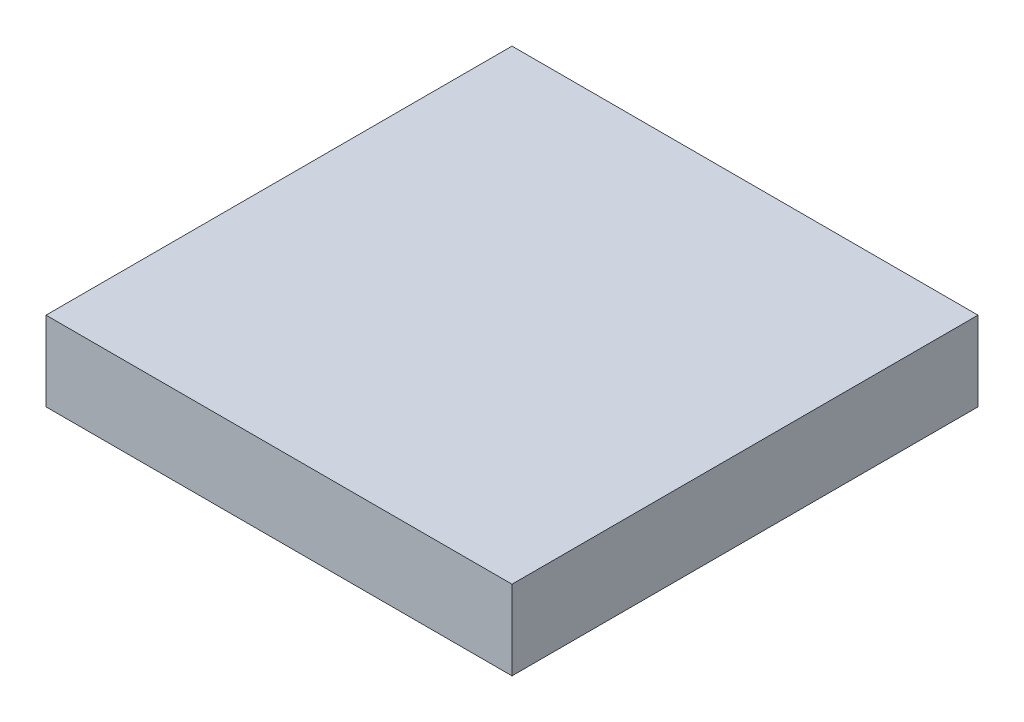
ISO-10303-21;
HEADER;
FILE_DESCRIPTION(('STEP AP214'),'2;1');
FILE_NAME('part.step','',(''),(''),'','','');
FILE_SCHEMA(('AUTOMOTIVE_DESIGN { 1 0 10303 214 1 1 1 1 }'));
ENDSEC;
DATA;
#1=APPLICATION_CONTEXT('core data for automotive mechanical design processes');
#2=APPLICATION_PROTOCOL_DEFINITION('international standard','automotive_design',2000,#1);
#3=PRODUCT_CONTEXT('',#1,'mechanical');
#4=PRODUCT('Part','Part','',(#3));
#5=PRODUCT_RELATED_PRODUCT_CATEGORY('part','',(#4));
#6=PRODUCT_DEFINITION_FORMATION('','',#4);
#7=PRODUCT_DEFINITION_CONTEXT('part definition',#1,'design');
#8=PRODUCT_DEFINITION('design','',#6,#7);
#9=PRODUCT_DEFINITION_SHAPE('','',#8);
#10=(LENGTH_UNIT() NAMED_UNIT(*) SI_UNIT(.MILLI.,.METRE.));
#11=(NAMED_UNIT(*) PLANE_ANGLE_UNIT() SI_UNIT($,.RADIAN.));
#12=(NAMED_UNIT(*) SI_UNIT($,.STERADIAN.) SOLID_ANGLE_UNIT());
#13=UNCERTAINTY_MEASURE_WITH_UNIT(LENGTH_MEASURE(1.E-05),#10,'distance_accuracy_value','');
#14=(GEOMETRIC_REPRESENTATION_CONTEXT(3) GLOBAL_UNCERTAINTY_ASSIGNED_CONTEXT((#13)) GLOBAL_UNIT_ASSIGNED_CONTEXT((#10,
#11,#12)) REPRESENTATION_CONTEXT('',''));
#15=CARTESIAN_POINT('',(0.,0.,0.));
#16=DIRECTION('',(0.,0.,1.));
#17=DIRECTION('',(1.,0.,0.));
#18=AXIS2_PLACEMENT_3D('',#15,#16,#17);
#19=CARTESIAN_POINT('',(-11.,3.75,11.));
#20=DIRECTION('',(1.,0.,0.));
#21=DIRECTION('',(0.,0.,-1.));
#22=AXIS2_PLACEMENT_3D('',#19,#20,#21);
#23=PLANE('',#22);
#24=DIRECTION('',(0.,0.,1.));
#25=VECTOR('',#24,1.);
#26=CARTESIAN_POINT('',(-11.,0.,11.));
#27=LINE('',#26,#25);
#28=CARTESIAN_POINT('',(-11.,0.,-11.));
#29=VERTEX_POINT('',#28);
#30=CARTESIAN_POINT('',(-11.,0.,11.));
#31=VERTEX_POINT('',#30);
#32=EDGE_CURVE('E96',#29,#31,#27,.T.);
#33=ORIENTED_EDGE('',*,*,#32,.T.);
#34=DIRECTION('',(0.,-1.,0.));
#35=VECTOR('',#34,1.);
#36=CARTESIAN_POINT('',(-11.,3.75,11.));
#37=LINE('',#36,#35);
#38=CARTESIAN_POINT('',(-11.,3.75,11.));
#39=VERTEX_POINT('',#38);
#40=EDGE_CURVE('E11',#39,#31,#37,.T.);
#41=ORIENTED_EDGE('',*,*,#40,.F.);
#42=DIRECTION('',(0.,0.,1.));
#43=VECTOR('',#42,1.);
#44=CARTESIAN_POINT('',(-11.,3.75,11.));
#45=LINE('',#44,#43);
#46=CARTESIAN_POINT('',(-11.,3.75,-11.));
#47=VERTEX_POINT('',#46);
#48=EDGE_CURVE('E84',#47,#39,#45,.T.);
#49=ORIENTED_EDGE('',*,*,#48,.F.);
#50=DIRECTION('',(0.,-1.,0.));
#51=VECTOR('',#50,1.);
#52=CARTESIAN_POINT('',(-11.,3.75,-11.));
#53=LINE('',#52,#51);
#54=EDGE_CURVE('E92',#47,#29,#53,.T.);
#55=ORIENTED_EDGE('',*,*,#54,.T.);
#56=EDGE_LOOP('',(#33,#41,#49,#55));
#57=FACE_BOUND('',#56,.T.);
#58=ADVANCED_FACE('F33',(#57),#23,.F.);
#59=CARTESIAN_POINT('',(11.,3.75,11.));
#60=DIRECTION('',(0.,0.,-1.));
#61=DIRECTION('',(-1.,0.,0.));
#62=AXIS2_PLACEMENT_3D('',#59,#60,#61);
#63=PLANE('',#62);
#64=DIRECTION('',(1.,0.,0.));
#65=VECTOR('',#64,1.);
#66=CARTESIAN_POINT('',(11.,0.,11.));
#67=LINE('',#66,#65);
#68=CARTESIAN_POINT('',(11.,0.,11.));
#69=VERTEX_POINT('',#68);
#70=EDGE_CURVE('E88',#31,#69,#67,.T.);
#71=ORIENTED_EDGE('',*,*,#70,.T.);
#72=DIRECTION('',(0.,-1.,0.));
#73=VECTOR('',#72,1.);
#74=CARTESIAN_POINT('',(11.,3.75,11.));
#75=LINE('',#74,#73);
#76=CARTESIAN_POINT('',(11.,3.75,11.));
#77=VERTEX_POINT('',#76);
#78=EDGE_CURVE('E41',#77,#69,#75,.T.);
#79=ORIENTED_EDGE('',*,*,#78,.F.);
#80=DIRECTION('',(1.,0.,0.));
#81=VECTOR('',#80,1.);
#82=CARTESIAN_POINT('',(11.,3.75,11.));
#83=LINE('',#82,#81);
#84=EDGE_CURVE('E79',#39,#77,#83,.T.);
#85=ORIENTED_EDGE('',*,*,#84,.F.);
#86=ORIENTED_EDGE('',*,*,#40,.T.);
#87=EDGE_LOOP('',(#71,#79,#85,#86));
#88=FACE_BOUND('',#87,.T.);
#89=ADVANCED_FACE('F87',(#88),#63,.F.);
#90=CARTESIAN_POINT('',(11.,3.75,11.));
#91=DIRECTION('',(-1.,0.,0.));
#92=DIRECTION('',(0.,0.,1.));
#93=AXIS2_PLACEMENT_3D('',#90,#91,#92);
#94=PLANE('',#93);
#95=DIRECTION('',(0.,0.,-1.));
#96=VECTOR('',#95,1.);
#97=CARTESIAN_POINT('',(11.,0.,11.));
#98=LINE('',#97,#96);
#99=CARTESIAN_POINT('',(11.,0.,-11.));
#100=VERTEX_POINT('',#99);
#101=EDGE_CURVE('E66',#69,#100,#98,.T.);
#102=ORIENTED_EDGE('',*,*,#101,.T.);
#103=DIRECTION('',(0.,-1.,0.));
#104=VECTOR('',#103,1.);
#105=CARTESIAN_POINT('',(11.,3.75,-11.));
#106=LINE('',#105,#104);
#107=CARTESIAN_POINT('',(11.,3.75,-11.));
#108=VERTEX_POINT('',#107);
#109=EDGE_CURVE('E89',#108,#100,#106,.T.);
#110=ORIENTED_EDGE('',*,*,#109,.F.);
#111=DIRECTION('',(0.,0.,-1.));
#112=VECTOR('',#111,1.);
#113=CARTESIAN_POINT('',(11.,3.75,11.));
#114=LINE('',#113,#112);
#115=EDGE_CURVE('E82',#77,#108,#114,.T.);
#116=ORIENTED_EDGE('',*,*,#115,.F.);
#117=ORIENTED_EDGE('',*,*,#78,.T.);
#118=EDGE_LOOP('',(#102,#110,#116,#117));
#119=FACE_BOUND('',#118,.T.);
#120=ADVANCED_FACE('F90',(#119),#94,.F.);
#121=CARTESIAN_POINT('',(11.,3.75,-11.));
#122=DIRECTION('',(0.,0.,1.));
#123=DIRECTION('',(1.,0.,0.));
#124=AXIS2_PLACEMENT_3D('',#121,#122,#123);
#125=PLANE('',#124);
#126=DIRECTION('',(-1.,0.,0.));
#127=VECTOR('',#126,1.);
#128=CARTESIAN_POINT('',(11.,0.,-11.));
#129=LINE('',#128,#127);
#130=EDGE_CURVE('E72',#100,#29,#129,.T.);
#131=ORIENTED_EDGE('',*,*,#130,.T.);
#132=ORIENTED_EDGE('',*,*,#54,.F.);
#133=DIRECTION('',(-1.,0.,0.));
#134=VECTOR('',#133,1.);
#135=CARTESIAN_POINT('',(11.,3.75,-11.));
#136=LINE('',#135,#134);
#137=EDGE_CURVE('E49',#108,#47,#136,.T.);
#138=ORIENTED_EDGE('',*,*,#137,.F.);
#139=ORIENTED_EDGE('',*,*,#109,.T.);
#140=EDGE_LOOP('',(#131,#132,#138,#139));
#141=FACE_BOUND('',#140,.T.);
#142=ADVANCED_FACE('F103',(#141),#125,.F.);
#143=CARTESIAN_POINT('',(0.,3.75,0.));
#144=DIRECTION('',(0.,1.,0.));
#145=DIRECTION('',(0.,0.,1.));
#146=AXIS2_PLACEMENT_3D('',#143,#144,#145);
#147=PLANE('',#146);
#148=ORIENTED_EDGE('',*,*,#48,.T.);
#149=ORIENTED_EDGE('',*,*,#84,.T.);
#150=ORIENTED_EDGE('',*,*,#115,.T.);
#151=ORIENTED_EDGE('',*,*,#137,.T.);
#152=EDGE_LOOP('',(#148,#149,#150,#151));
#153=FACE_BOUND('',#152,.T.);
#154=ADVANCED_FACE('F80',(#153),#147,.T.);
#155=CARTESIAN_POINT('',(0.,0.,0.));
#156=DIRECTION('',(0.,1.,0.));
#157=DIRECTION('',(0.,0.,1.));
#158=AXIS2_PLACEMENT_3D('',#155,#156,#157);
#159=PLANE('',#158);
#160=ORIENTED_EDGE('',*,*,#32,.F.);
#161=ORIENTED_EDGE('',*,*,#130,.F.);
#162=ORIENTED_EDGE('',*,*,#101,.F.);
#163=ORIENTED_EDGE('',*,*,#70,.F.);
#164=EDGE_LOOP('',(#160,#161,#162,#163));
#165=FACE_BOUND('',#164,.T.);
#166=ADVANCED_FACE('F106',(#165),#159,.F.);
#167=CLOSED_SHELL('',(#58,#89,#120,#142,#154,#166));
#168=MANIFOLD_SOLID_BREP('B2',#167);
#169=ADVANCED_BREP_SHAPE_REPRESENTATION('',(#18,#168),#14);
#170=SHAPE_DEFINITION_REPRESENTATION(#9,#169);
ENDSEC;
END-ISO-10303-21;
